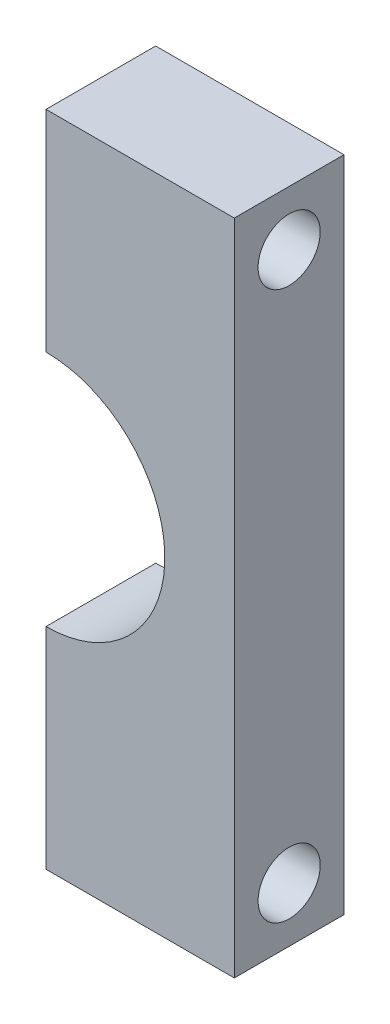
ISO-10303-21;
HEADER;
FILE_DESCRIPTION(('STEP AP214'),'2;1');
FILE_NAME('part.step','',(''),(''),'','','');
FILE_SCHEMA(('AUTOMOTIVE_DESIGN { 1 0 10303 214 1 1 1 1 }'));
ENDSEC;
DATA;
#1=APPLICATION_CONTEXT('core data for automotive mechanical design processes');
#2=APPLICATION_PROTOCOL_DEFINITION('international standard','automotive_design',2000,#1);
#3=PRODUCT_CONTEXT('',#1,'mechanical');
#4=PRODUCT('Part','Part','',(#3));
#5=PRODUCT_RELATED_PRODUCT_CATEGORY('part','',(#4));
#6=PRODUCT_DEFINITION_FORMATION('','',#4);
#7=PRODUCT_DEFINITION_CONTEXT('part definition',#1,'design');
#8=PRODUCT_DEFINITION('design','',#6,#7);
#9=PRODUCT_DEFINITION_SHAPE('','',#8);
#10=(LENGTH_UNIT() NAMED_UNIT(*) SI_UNIT(.MILLI.,.METRE.));
#11=(NAMED_UNIT(*) PLANE_ANGLE_UNIT() SI_UNIT($,.RADIAN.));
#12=(NAMED_UNIT(*) SI_UNIT($,.STERADIAN.) SOLID_ANGLE_UNIT());
#13=UNCERTAINTY_MEASURE_WITH_UNIT(LENGTH_MEASURE(1.E-05),#10,'distance_accuracy_value','');
#14=(GEOMETRIC_REPRESENTATION_CONTEXT(3) GLOBAL_UNCERTAINTY_ASSIGNED_CONTEXT((#13)) GLOBAL_UNIT_ASSIGNED_CONTEXT((#10,
#11,#12)) REPRESENTATION_CONTEXT('',''));
#15=CARTESIAN_POINT('',(0.,0.,0.));
#16=DIRECTION('',(0.,0.,1.));
#17=DIRECTION('',(1.,0.,0.));
#18=AXIS2_PLACEMENT_3D('',#15,#16,#17);
#19=CARTESIAN_POINT('',(0.,0.,30.));
#20=DIRECTION('',(1.,0.,0.));
#21=DIRECTION('',(0.,0.,-1.));
#22=AXIS2_PLACEMENT_3D('',#19,#20,#21);
#23=PLANE('',#22);
#24=CARTESIAN_POINT('',(0.,48.5,15.));
#25=DIRECTION('',(-1.,0.,0.));
#26=DIRECTION('',(0.,0.,1.));
#27=AXIS2_PLACEMENT_3D('',#24,#25,#26);
#28=CIRCLE('',#27,4.75000000000001);
#29=CARTESIAN_POINT('',(0.,48.5,19.75));
#30=VERTEX_POINT('',#29);
#31=EDGE_CURVE('E164',#30,#30,#28,.T.);
#32=ORIENTED_EDGE('',*,*,#31,.F.);
#33=EDGE_LOOP('',(#32));
#34=FACE_BOUND('',#33,.T.);
#35=CARTESIAN_POINT('',(0.,15.,15.));
#36=DIRECTION('',(-1.,0.,0.));
#37=DIRECTION('',(0.,0.,1.));
#38=AXIS2_PLACEMENT_3D('',#35,#36,#37);
#39=CIRCLE('',#38,8.5);
#40=CARTESIAN_POINT('',(0.,15.,23.5));
#41=VERTEX_POINT('',#40);
#42=EDGE_CURVE('E167',#41,#41,#39,.T.);
#43=ORIENTED_EDGE('',*,*,#42,.F.);
#44=EDGE_LOOP('',(#43));
#45=FACE_BOUND('',#44,.T.);
#46=DIRECTION('',(0.,-1.,0.));
#47=VECTOR('',#46,1.);
#48=CARTESIAN_POINT('',(0.,0.,0.));
#49=LINE('',#48,#47);
#50=CARTESIAN_POINT('',(0.,57.5,0.));
#51=VERTEX_POINT('',#50);
#52=CARTESIAN_POINT('',(0.,0.,0.));
#53=VERTEX_POINT('',#52);
#54=EDGE_CURVE('E120',#51,#53,#49,.T.);
#55=ORIENTED_EDGE('',*,*,#54,.T.);
#56=DIRECTION('',(0.,0.,-1.));
#57=VECTOR('',#56,1.);
#58=CARTESIAN_POINT('',(0.,0.,30.));
#59=LINE('',#58,#57);
#60=CARTESIAN_POINT('',(0.,0.,30.));
#61=VERTEX_POINT('',#60);
#62=EDGE_CURVE('E11',#61,#53,#59,.T.);
#63=ORIENTED_EDGE('',*,*,#62,.F.);
#64=DIRECTION('',(0.,-1.,0.));
#65=VECTOR('',#64,1.);
#66=CARTESIAN_POINT('',(0.,0.,30.));
#67=LINE('',#66,#65);
#68=CARTESIAN_POINT('',(0.,57.5,30.));
#69=VERTEX_POINT('',#68);
#70=EDGE_CURVE('E131',#69,#61,#67,.T.);
#71=ORIENTED_EDGE('',*,*,#70,.F.);
#72=DIRECTION('',(0.,0.,-1.));
#73=VECTOR('',#72,1.);
#74=CARTESIAN_POINT('',(0.,57.5,30.));
#75=LINE('',#74,#73);
#76=EDGE_CURVE('E116',#69,#51,#75,.T.);
#77=ORIENTED_EDGE('',*,*,#76,.T.);
#78=EDGE_LOOP('',(#55,#63,#71,#77));
#79=FACE_BOUND('',#78,.T.);
#80=ADVANCED_FACE('F36',(#34,#45,#79),#23,.F.);
#81=CARTESIAN_POINT('',(0.,0.,30.));
#82=DIRECTION('',(0.,1.,0.));
#83=DIRECTION('',(0.,0.,1.));
#84=AXIS2_PLACEMENT_3D('',#81,#82,#83);
#85=PLANE('',#84);
#86=DIRECTION('',(1.,0.,0.));
#87=VECTOR('',#86,1.);
#88=CARTESIAN_POINT('',(0.,0.,0.));
#89=LINE('',#88,#87);
#90=CARTESIAN_POINT('',(51.5,0.,0.));
#91=VERTEX_POINT('',#90);
#92=EDGE_CURVE('E123',#53,#91,#89,.T.);
#93=ORIENTED_EDGE('',*,*,#92,.T.);
#94=DIRECTION('',(0.,0.,-1.));
#95=VECTOR('',#94,1.);
#96=CARTESIAN_POINT('',(51.5,0.,30.));
#97=LINE('',#96,#95);
#98=CARTESIAN_POINT('',(51.5,0.,30.));
#99=VERTEX_POINT('',#98);
#100=EDGE_CURVE('E44',#99,#91,#97,.T.);
#101=ORIENTED_EDGE('',*,*,#100,.F.);
#102=DIRECTION('',(1.,0.,0.));
#103=VECTOR('',#102,1.);
#104=CARTESIAN_POINT('',(0.,0.,30.));
#105=LINE('',#104,#103);
#106=EDGE_CURVE('E89',#61,#99,#105,.T.);
#107=ORIENTED_EDGE('',*,*,#106,.F.);
#108=ORIENTED_EDGE('',*,*,#62,.T.);
#109=EDGE_LOOP('',(#93,#101,#107,#108));
#110=FACE_BOUND('',#109,.T.);
#111=ADVANCED_FACE('F156',(#110),#85,.F.);
#112=CARTESIAN_POINT('',(51.5,0.,30.));
#113=DIRECTION('',(-1.,0.,0.));
#114=DIRECTION('',(0.,0.,1.));
#115=AXIS2_PLACEMENT_3D('',#112,#113,#114);
#116=PLANE('',#115);
#117=CARTESIAN_POINT('',(51.5,165.,15.));
#118=DIRECTION('',(-1.,0.,0.));
#119=DIRECTION('',(0.,0.,1.));
#120=AXIS2_PLACEMENT_3D('',#117,#118,#119);
#121=CIRCLE('',#120,8.5);
#122=CARTESIAN_POINT('',(51.5,165.,23.5));
#123=VERTEX_POINT('',#122);
#124=EDGE_CURVE('E169',#123,#123,#121,.T.);
#125=ORIENTED_EDGE('',*,*,#124,.T.);
#126=EDGE_LOOP('',(#125));
#127=FACE_BOUND('',#126,.T.);
#128=CARTESIAN_POINT('',(51.5,15.,15.));
#129=DIRECTION('',(-1.,0.,0.));
#130=DIRECTION('',(0.,0.,1.));
#131=AXIS2_PLACEMENT_3D('',#128,#129,#130);
#132=CIRCLE('',#131,8.5);
#133=CARTESIAN_POINT('',(51.5,15.,23.5));
#134=VERTEX_POINT('',#133);
#135=EDGE_CURVE('E124',#134,#134,#132,.T.);
#136=ORIENTED_EDGE('',*,*,#135,.T.);
#137=EDGE_LOOP('',(#136));
#138=FACE_BOUND('',#137,.T.);
#139=DIRECTION('',(0.,1.,0.));
#140=VECTOR('',#139,1.);
#141=CARTESIAN_POINT('',(51.5,0.,0.));
#142=LINE('',#141,#140);
#143=CARTESIAN_POINT('',(51.5,180.,0.));
#144=VERTEX_POINT('',#143);
#145=EDGE_CURVE('E126',#91,#144,#142,.T.);
#146=ORIENTED_EDGE('',*,*,#145,.T.);
#147=DIRECTION('',(0.,0.,-1.));
#148=VECTOR('',#147,1.);
#149=CARTESIAN_POINT('',(51.5,180.,30.));
#150=LINE('',#149,#148);
#151=CARTESIAN_POINT('',(51.5,180.,30.));
#152=VERTEX_POINT('',#151);
#153=EDGE_CURVE('E111',#152,#144,#150,.T.);
#154=ORIENTED_EDGE('',*,*,#153,.F.);
#155=DIRECTION('',(0.,1.,0.));
#156=VECTOR('',#155,1.);
#157=CARTESIAN_POINT('',(51.5,0.,30.));
#158=LINE('',#157,#156);
#159=EDGE_CURVE('E102',#99,#152,#158,.T.);
#160=ORIENTED_EDGE('',*,*,#159,.F.);
#161=ORIENTED_EDGE('',*,*,#100,.T.);
#162=EDGE_LOOP('',(#146,#154,#160,#161));
#163=FACE_BOUND('',#162,.T.);
#164=ADVANCED_FACE('F137',(#127,#138,#163),#116,.F.);
#165=CARTESIAN_POINT('',(0.,180.,30.));
#166=DIRECTION('',(0.,-1.,0.));
#167=DIRECTION('',(0.,0.,-1.));
#168=AXIS2_PLACEMENT_3D('',#165,#166,#167);
#169=PLANE('',#168);
#170=DIRECTION('',(-1.,0.,0.));
#171=VECTOR('',#170,1.);
#172=CARTESIAN_POINT('',(0.,180.,0.));
#173=LINE('',#172,#171);
#174=CARTESIAN_POINT('',(0.,180.,0.));
#175=VERTEX_POINT('',#174);
#176=EDGE_CURVE('E110',#144,#175,#173,.T.);
#177=ORIENTED_EDGE('',*,*,#176,.T.);
#178=DIRECTION('',(0.,0.,-1.));
#179=VECTOR('',#178,1.);
#180=CARTESIAN_POINT('',(0.,180.,30.));
#181=LINE('',#180,#179);
#182=CARTESIAN_POINT('',(0.,180.,30.));
#183=VERTEX_POINT('',#182);
#184=EDGE_CURVE('E107',#183,#175,#181,.T.);
#185=ORIENTED_EDGE('',*,*,#184,.F.);
#186=DIRECTION('',(-1.,0.,0.));
#187=VECTOR('',#186,1.);
#188=CARTESIAN_POINT('',(0.,180.,30.));
#189=LINE('',#188,#187);
#190=EDGE_CURVE('E96',#152,#183,#189,.T.);
#191=ORIENTED_EDGE('',*,*,#190,.F.);
#192=ORIENTED_EDGE('',*,*,#153,.T.);
#193=EDGE_LOOP('',(#177,#185,#191,#192));
#194=FACE_BOUND('',#193,.T.);
#195=ADVANCED_FACE('F108',(#194),#169,.F.);
#196=CARTESIAN_POINT('',(0.,122.5,30.));
#197=DIRECTION('',(1.,0.,0.));
#198=DIRECTION('',(0.,0.,-1.));
#199=AXIS2_PLACEMENT_3D('',#196,#197,#198);
#200=PLANE('',#199);
#201=CARTESIAN_POINT('',(0.,131.5,15.));
#202=DIRECTION('',(-1.,0.,0.));
#203=DIRECTION('',(0.,0.,1.));
#204=AXIS2_PLACEMENT_3D('',#201,#202,#203);
#205=CIRCLE('',#204,4.75000000000001);
#206=CARTESIAN_POINT('',(0.,131.5,19.75));
#207=VERTEX_POINT('',#206);
#208=EDGE_CURVE('E186',#207,#207,#205,.T.);
#209=ORIENTED_EDGE('',*,*,#208,.F.);
#210=EDGE_LOOP('',(#209));
#211=FACE_BOUND('',#210,.T.);
#212=CARTESIAN_POINT('',(0.,165.,15.));
#213=DIRECTION('',(-1.,0.,0.));
#214=DIRECTION('',(0.,0.,1.));
#215=AXIS2_PLACEMENT_3D('',#212,#213,#214);
#216=CIRCLE('',#215,8.5);
#217=CARTESIAN_POINT('',(0.,165.,23.5));
#218=VERTEX_POINT('',#217);
#219=EDGE_CURVE('E174',#218,#218,#216,.T.);
#220=ORIENTED_EDGE('',*,*,#219,.F.);
#221=EDGE_LOOP('',(#220));
#222=FACE_BOUND('',#221,.T.);
#223=DIRECTION('',(0.,-1.,0.));
#224=VECTOR('',#223,1.);
#225=CARTESIAN_POINT('',(0.,122.5,0.));
#226=LINE('',#225,#224);
#227=CARTESIAN_POINT('',(0.,122.5,0.));
#228=VERTEX_POINT('',#227);
#229=EDGE_CURVE('E75',#175,#228,#226,.T.);
#230=ORIENTED_EDGE('',*,*,#229,.T.);
#231=DIRECTION('',(0.,0.,-1.));
#232=VECTOR('',#231,1.);
#233=CARTESIAN_POINT('',(0.,122.5,30.));
#234=LINE('',#233,#232);
#235=CARTESIAN_POINT('',(0.,122.5,30.));
#236=VERTEX_POINT('',#235);
#237=EDGE_CURVE('E112',#236,#228,#234,.T.);
#238=ORIENTED_EDGE('',*,*,#237,.F.);
#239=DIRECTION('',(0.,-1.,0.));
#240=VECTOR('',#239,1.);
#241=CARTESIAN_POINT('',(0.,122.5,30.));
#242=LINE('',#241,#240);
#243=EDGE_CURVE('E100',#183,#236,#242,.T.);
#244=ORIENTED_EDGE('',*,*,#243,.F.);
#245=ORIENTED_EDGE('',*,*,#184,.T.);
#246=EDGE_LOOP('',(#230,#238,#244,#245));
#247=FACE_BOUND('',#246,.T.);
#248=ADVANCED_FACE('F114',(#211,#222,#247),#200,.F.);
#249=CARTESIAN_POINT('',(0.,90.,30.));
#250=DIRECTION('',(0.,0.,-1.));
#251=DIRECTION('',(-1.,0.,0.));
#252=AXIS2_PLACEMENT_3D('',#249,#250,#251);
#253=CYLINDRICAL_SURFACE('',#252,32.5);
#254=CARTESIAN_POINT('',(0.,90.,0.));
#255=DIRECTION('',(0.,0.,-1.));
#256=DIRECTION('',(1.,0.,0.));
#257=AXIS2_PLACEMENT_3D('',#254,#255,#256);
#258=CIRCLE('',#257,32.5);
#259=EDGE_CURVE('E81',#228,#51,#258,.T.);
#260=ORIENTED_EDGE('',*,*,#259,.T.);
#261=ORIENTED_EDGE('',*,*,#76,.F.);
#262=CARTESIAN_POINT('',(0.,90.,30.));
#263=DIRECTION('',(0.,0.,-1.));
#264=DIRECTION('',(1.,0.,0.));
#265=AXIS2_PLACEMENT_3D('',#262,#263,#264);
#266=CIRCLE('',#265,32.5);
#267=EDGE_CURVE('E52',#236,#69,#266,.T.);
#268=ORIENTED_EDGE('',*,*,#267,.F.);
#269=ORIENTED_EDGE('',*,*,#237,.T.);
#270=EDGE_LOOP('',(#260,#261,#268,#269));
#271=FACE_BOUND('',#270,.T.);
#272=ADVANCED_FACE('F144',(#271),#253,.F.);
#273=CARTESIAN_POINT('',(0.,90.,30.));
#274=DIRECTION('',(0.,0.,1.));
#275=DIRECTION('',(1.,0.,0.));
#276=AXIS2_PLACEMENT_3D('',#273,#274,#275);
#277=PLANE('',#276);
#278=ORIENTED_EDGE('',*,*,#70,.T.);
#279=ORIENTED_EDGE('',*,*,#106,.T.);
#280=ORIENTED_EDGE('',*,*,#159,.T.);
#281=ORIENTED_EDGE('',*,*,#190,.T.);
#282=ORIENTED_EDGE('',*,*,#243,.T.);
#283=ORIENTED_EDGE('',*,*,#267,.T.);
#284=EDGE_LOOP('',(#278,#279,#280,#281,#282,#283));
#285=FACE_BOUND('',#284,.T.);
#286=ADVANCED_FACE('F98',(#285),#277,.T.);
#287=CARTESIAN_POINT('',(0.,90.,0.));
#288=DIRECTION('',(0.,0.,1.));
#289=DIRECTION('',(1.,0.,0.));
#290=AXIS2_PLACEMENT_3D('',#287,#288,#289);
#291=PLANE('',#290);
#292=ORIENTED_EDGE('',*,*,#54,.F.);
#293=ORIENTED_EDGE('',*,*,#259,.F.);
#294=ORIENTED_EDGE('',*,*,#229,.F.);
#295=ORIENTED_EDGE('',*,*,#176,.F.);
#296=ORIENTED_EDGE('',*,*,#145,.F.);
#297=ORIENTED_EDGE('',*,*,#92,.F.);
#298=EDGE_LOOP('',(#292,#293,#294,#295,#296,#297));
#299=FACE_BOUND('',#298,.T.);
#300=ADVANCED_FACE('F140',(#299),#291,.F.);
#301=CARTESIAN_POINT('',(51.5,15.,15.));
#302=DIRECTION('',(-1.,0.,0.));
#303=DIRECTION('',(0.,0.,1.));
#304=AXIS2_PLACEMENT_3D('',#301,#302,#303);
#305=CYLINDRICAL_SURFACE('',#304,8.5);
#306=ORIENTED_EDGE('',*,*,#135,.F.);
#307=EDGE_LOOP('',(#306));
#308=FACE_BOUND('',#307,.T.);
#309=ORIENTED_EDGE('',*,*,#42,.T.);
#310=EDGE_LOOP('',(#309));
#311=FACE_BOUND('',#310,.T.);
#312=ADVANCED_FACE('F206',(#308,#311),#305,.F.);
#313=CARTESIAN_POINT('',(51.5,165.,15.));
#314=DIRECTION('',(-1.,0.,0.));
#315=DIRECTION('',(0.,0.,1.));
#316=AXIS2_PLACEMENT_3D('',#313,#314,#315);
#317=CYLINDRICAL_SURFACE('',#316,8.5);
#318=ORIENTED_EDGE('',*,*,#124,.F.);
#319=EDGE_LOOP('',(#318));
#320=FACE_BOUND('',#319,.T.);
#321=ORIENTED_EDGE('',*,*,#219,.T.);
#322=EDGE_LOOP('',(#321));
#323=FACE_BOUND('',#322,.T.);
#324=ADVANCED_FACE('F203',(#320,#323),#317,.F.);
#325=CARTESIAN_POINT('',(15.,48.5,15.));
#326=DIRECTION('',(-1.,0.,0.));
#327=DIRECTION('',(0.,0.,1.));
#328=AXIS2_PLACEMENT_3D('',#325,#326,#327);
#329=CYLINDRICAL_SURFACE('',#328,4.75000000000001);
#330=CARTESIAN_POINT('',(15.,48.5,15.));
#331=DIRECTION('',(-1.,0.,0.));
#332=DIRECTION('',(0.,0.,1.));
#333=AXIS2_PLACEMENT_3D('',#330,#331,#332);
#334=CIRCLE('',#333,4.75000000000001);
#335=CARTESIAN_POINT('',(15.,48.5,19.75));
#336=VERTEX_POINT('',#335);
#337=EDGE_CURVE('E180',#336,#336,#334,.T.);
#338=ORIENTED_EDGE('',*,*,#337,.F.);
#339=EDGE_LOOP('',(#338));
#340=FACE_BOUND('',#339,.T.);
#341=ORIENTED_EDGE('',*,*,#31,.T.);
#342=EDGE_LOOP('',(#341));
#343=FACE_BOUND('',#342,.T.);
#344=ADVANCED_FACE('F205',(#340,#343),#329,.F.);
#345=CARTESIAN_POINT('',(15.,48.5,15.));
#346=DIRECTION('',(-1.,0.,0.));
#347=DIRECTION('',(0.,0.,1.));
#348=AXIS2_PLACEMENT_3D('',#345,#346,#347);
#349=PLANE('',#348);
#350=ORIENTED_EDGE('',*,*,#337,.T.);
#351=EDGE_LOOP('',(#350));
#352=FACE_BOUND('',#351,.T.);
#353=ADVANCED_FACE('F197',(#352),#349,.T.);
#354=CARTESIAN_POINT('',(15.,131.5,15.));
#355=DIRECTION('',(-1.,0.,0.));
#356=DIRECTION('',(0.,0.,1.));
#357=AXIS2_PLACEMENT_3D('',#354,#355,#356);
#358=CYLINDRICAL_SURFACE('',#357,4.75000000000001);
#359=CARTESIAN_POINT('',(15.,131.5,15.));
#360=DIRECTION('',(-1.,0.,0.));
#361=DIRECTION('',(0.,0.,1.));
#362=AXIS2_PLACEMENT_3D('',#359,#360,#361);
#363=CIRCLE('',#362,4.75000000000001);
#364=CARTESIAN_POINT('',(15.,131.5,19.75));
#365=VERTEX_POINT('',#364);
#366=EDGE_CURVE('E183',#365,#365,#363,.T.);
#367=ORIENTED_EDGE('',*,*,#366,.F.);
#368=EDGE_LOOP('',(#367));
#369=FACE_BOUND('',#368,.T.);
#370=ORIENTED_EDGE('',*,*,#208,.T.);
#371=EDGE_LOOP('',(#370));
#372=FACE_BOUND('',#371,.T.);
#373=ADVANCED_FACE('F194',(#369,#372),#358,.F.);
#374=CARTESIAN_POINT('',(15.,131.5,15.));
#375=DIRECTION('',(-1.,0.,0.));
#376=DIRECTION('',(0.,0.,1.));
#377=AXIS2_PLACEMENT_3D('',#374,#375,#376);
#378=PLANE('',#377);
#379=ORIENTED_EDGE('',*,*,#366,.T.);
#380=EDGE_LOOP('',(#379));
#381=FACE_BOUND('',#380,.T.);
#382=ADVANCED_FACE('F192',(#381),#378,.T.);
#383=CLOSED_SHELL('',(#80,#111,#164,#195,#248,#272,#286,#300,#312,#324,#344,#353,#373,#382));
#384=MANIFOLD_SOLID_BREP('B2',#383);
#385=ADVANCED_BREP_SHAPE_REPRESENTATION('',(#18,#384),#14);
#386=SHAPE_DEFINITION_REPRESENTATION(#9,#385);
ENDSEC;
END-ISO-10303-21;
